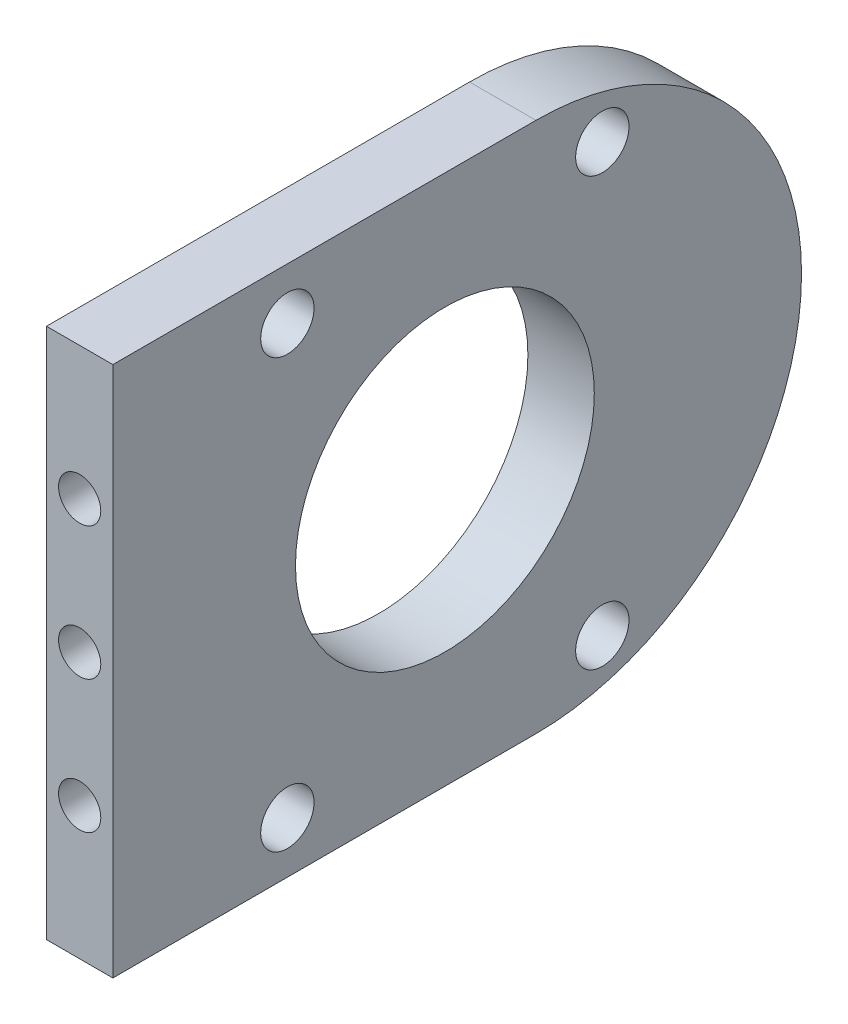
ISO-10303-21;
HEADER;
FILE_DESCRIPTION(('STEP AP214'),'2;1');
FILE_NAME('part.step','',(''),(''),'','','');
FILE_SCHEMA(('AUTOMOTIVE_DESIGN { 1 0 10303 214 1 1 1 1 }'));
ENDSEC;
DATA;
#1=APPLICATION_CONTEXT('core data for automotive mechanical design processes');
#2=APPLICATION_PROTOCOL_DEFINITION('international standard','automotive_design',2000,#1);
#3=PRODUCT_CONTEXT('',#1,'mechanical');
#4=PRODUCT('Part','Part','',(#3));
#5=PRODUCT_RELATED_PRODUCT_CATEGORY('part','',(#4));
#6=PRODUCT_DEFINITION_FORMATION('','',#4);
#7=PRODUCT_DEFINITION_CONTEXT('part definition',#1,'design');
#8=PRODUCT_DEFINITION('design','',#6,#7);
#9=PRODUCT_DEFINITION_SHAPE('','',#8);
#10=(LENGTH_UNIT() NAMED_UNIT(*) SI_UNIT(.MILLI.,.METRE.));
#11=(NAMED_UNIT(*) PLANE_ANGLE_UNIT() SI_UNIT($,.RADIAN.));
#12=(NAMED_UNIT(*) SI_UNIT($,.STERADIAN.) SOLID_ANGLE_UNIT());
#13=UNCERTAINTY_MEASURE_WITH_UNIT(LENGTH_MEASURE(1.E-05),#10,'distance_accuracy_value','');
#14=(GEOMETRIC_REPRESENTATION_CONTEXT(3) GLOBAL_UNCERTAINTY_ASSIGNED_CONTEXT((#13)) GLOBAL_UNIT_ASSIGNED_CONTEXT((#10,
#11,#12)) REPRESENTATION_CONTEXT('',''));
#15=CARTESIAN_POINT('',(0.,0.,0.));
#16=DIRECTION('',(0.,0.,1.));
#17=DIRECTION('',(1.,0.,0.));
#18=AXIS2_PLACEMENT_3D('',#15,#16,#17);
#19=CARTESIAN_POINT('',(6.35,25.4,38.1));
#20=DIRECTION('',(0.,-1.,0.));
#21=DIRECTION('',(0.,0.,-1.));
#22=AXIS2_PLACEMENT_3D('',#19,#20,#21);
#23=PLANE('',#22);
#24=DIRECTION('',(0.,0.,1.));
#25=VECTOR('',#24,1.);
#26=CARTESIAN_POINT('',(6.35,25.4,38.1));
#27=LINE('',#26,#25);
#28=CARTESIAN_POINT('',(6.35,25.4,-2.35410027771774));
#29=VERTEX_POINT('',#28);
#30=CARTESIAN_POINT('',(6.35,25.4,38.1));
#31=VERTEX_POINT('',#30);
#32=EDGE_CURVE('E133',#29,#31,#27,.T.);
#33=ORIENTED_EDGE('',*,*,#32,.F.);
#34=DIRECTION('',(1.,0.,0.));
#35=VECTOR('',#34,1.);
#36=CARTESIAN_POINT('',(6.35,25.4,-2.35410027771775));
#37=LINE('',#36,#35);
#38=CARTESIAN_POINT('',(0.,25.4,-2.35410027771774));
#39=VERTEX_POINT('',#38);
#40=EDGE_CURVE('E155',#29,#39,#37,.F.);
#41=ORIENTED_EDGE('',*,*,#40,.T.);
#42=DIRECTION('',(0.,0.,1.));
#43=VECTOR('',#42,1.);
#44=CARTESIAN_POINT('',(0.,25.4,38.1));
#45=LINE('',#44,#43);
#46=CARTESIAN_POINT('',(0.,25.4,38.1));
#47=VERTEX_POINT('',#46);
#48=EDGE_CURVE('E132',#39,#47,#45,.T.);
#49=ORIENTED_EDGE('',*,*,#48,.T.);
#50=DIRECTION('',(-1.,0.,0.));
#51=VECTOR('',#50,1.);
#52=CARTESIAN_POINT('',(6.35,25.4,38.1));
#53=LINE('',#52,#51);
#54=EDGE_CURVE('E148',#31,#47,#53,.T.);
#55=ORIENTED_EDGE('',*,*,#54,.F.);
#56=EDGE_LOOP('',(#33,#41,#49,#55));
#57=FACE_BOUND('',#56,.T.);
#58=ADVANCED_FACE('F51',(#57),#23,.F.);
#59=CARTESIAN_POINT('',(6.35,-25.4,38.1));
#60=DIRECTION('',(0.,0.,-1.));
#61=DIRECTION('',(-1.,0.,0.));
#62=AXIS2_PLACEMENT_3D('',#59,#60,#61);
#63=PLANE('',#62);
#64=CARTESIAN_POINT('',(3.175,-12.7,38.1));
#65=DIRECTION('',(0.,0.,1.));
#66=DIRECTION('',(1.,0.,0.));
#67=AXIS2_PLACEMENT_3D('',#64,#65,#66);
#68=CIRCLE('',#67,2.01929999999999);
#69=CARTESIAN_POINT('',(5.19429999999999,-12.7,38.1));
#70=VERTEX_POINT('',#69);
#71=EDGE_CURVE('E114',#70,#70,#68,.T.);
#72=ORIENTED_EDGE('',*,*,#71,.F.);
#73=EDGE_LOOP('',(#72));
#74=FACE_BOUND('',#73,.T.);
#75=CARTESIAN_POINT('',(3.175,0.,38.1));
#76=DIRECTION('',(0.,0.,1.));
#77=DIRECTION('',(1.,0.,0.));
#78=AXIS2_PLACEMENT_3D('',#75,#76,#77);
#79=CIRCLE('',#78,2.01929999999999);
#80=CARTESIAN_POINT('',(5.19429999999999,0.,38.1));
#81=VERTEX_POINT('',#80);
#82=EDGE_CURVE('E113',#81,#81,#79,.T.);
#83=ORIENTED_EDGE('',*,*,#82,.F.);
#84=EDGE_LOOP('',(#83));
#85=FACE_BOUND('',#84,.T.);
#86=CARTESIAN_POINT('',(3.175,12.7,38.1));
#87=DIRECTION('',(0.,0.,1.));
#88=DIRECTION('',(1.,0.,0.));
#89=AXIS2_PLACEMENT_3D('',#86,#87,#88);
#90=CIRCLE('',#89,2.01929999999999);
#91=CARTESIAN_POINT('',(5.19429999999999,12.7,38.1));
#92=VERTEX_POINT('',#91);
#93=EDGE_CURVE('E126',#92,#92,#90,.T.);
#94=ORIENTED_EDGE('',*,*,#93,.F.);
#95=EDGE_LOOP('',(#94));
#96=FACE_BOUND('',#95,.T.);
#97=DIRECTION('',(0.,-1.,0.));
#98=VECTOR('',#97,1.);
#99=CARTESIAN_POINT('',(0.,-25.4,38.1));
#100=LINE('',#99,#98);
#101=CARTESIAN_POINT('',(0.,-25.4,38.1));
#102=VERTEX_POINT('',#101);
#103=EDGE_CURVE('E143',#47,#102,#100,.T.);
#104=ORIENTED_EDGE('',*,*,#103,.T.);
#105=DIRECTION('',(-1.,0.,0.));
#106=VECTOR('',#105,1.);
#107=CARTESIAN_POINT('',(6.35,-25.4,38.1));
#108=LINE('',#107,#106);
#109=CARTESIAN_POINT('',(6.35,-25.4,38.1));
#110=VERTEX_POINT('',#109);
#111=EDGE_CURVE('E141',#110,#102,#108,.T.);
#112=ORIENTED_EDGE('',*,*,#111,.F.);
#113=DIRECTION('',(0.,-1.,0.));
#114=VECTOR('',#113,1.);
#115=CARTESIAN_POINT('',(6.35,-25.4,38.1));
#116=LINE('',#115,#114);
#117=EDGE_CURVE('E135',#31,#110,#116,.T.);
#118=ORIENTED_EDGE('',*,*,#117,.F.);
#119=ORIENTED_EDGE('',*,*,#54,.T.);
#120=EDGE_LOOP('',(#104,#112,#118,#119));
#121=FACE_BOUND('',#120,.T.);
#122=ADVANCED_FACE('F170',(#74,#85,#96,#121),#63,.F.);
#123=CARTESIAN_POINT('',(6.35,-25.4,38.1));
#124=DIRECTION('',(0.,1.,0.));
#125=DIRECTION('',(0.,0.,1.));
#126=AXIS2_PLACEMENT_3D('',#123,#124,#125);
#127=PLANE('',#126);
#128=DIRECTION('',(0.,0.,-1.));
#129=VECTOR('',#128,1.);
#130=CARTESIAN_POINT('',(0.,-25.4,38.1));
#131=LINE('',#130,#129);
#132=CARTESIAN_POINT('',(0.,-25.4,-2.35410027771774));
#133=VERTEX_POINT('',#132);
#134=EDGE_CURVE('E136',#102,#133,#131,.T.);
#135=ORIENTED_EDGE('',*,*,#134,.T.);
#136=DIRECTION('',(1.,0.,0.));
#137=VECTOR('',#136,1.);
#138=CARTESIAN_POINT('',(6.35,-25.4,-2.35410027771775));
#139=LINE('',#138,#137);
#140=CARTESIAN_POINT('',(6.35,-25.4,-2.35410027771774));
#141=VERTEX_POINT('',#140);
#142=EDGE_CURVE('E11',#133,#141,#139,.T.);
#143=ORIENTED_EDGE('',*,*,#142,.T.);
#144=DIRECTION('',(0.,0.,-1.));
#145=VECTOR('',#144,1.);
#146=CARTESIAN_POINT('',(6.35,-25.4,38.1));
#147=LINE('',#146,#145);
#148=EDGE_CURVE('E138',#110,#141,#147,.T.);
#149=ORIENTED_EDGE('',*,*,#148,.F.);
#150=ORIENTED_EDGE('',*,*,#111,.T.);
#151=EDGE_LOOP('',(#135,#143,#149,#150));
#152=FACE_BOUND('',#151,.T.);
#153=ADVANCED_FACE('F174',(#152),#127,.F.);
#154=CARTESIAN_POINT('',(6.35,0.,0.));
#155=DIRECTION('',(-1.,0.,0.));
#156=DIRECTION('',(0.,0.,1.));
#157=AXIS2_PLACEMENT_3D('',#154,#155,#156);
#158=PLANE('',#157);
#159=CARTESIAN_POINT('',(6.35,-20.4408227755738,-8.70410027771775));
#160=DIRECTION('',(-1.,0.,0.));
#161=DIRECTION('',(0.,0.,1.));
#162=AXIS2_PLACEMENT_3D('',#159,#160,#161);
#163=CIRCLE('',#162,2.5527);
#164=CARTESIAN_POINT('',(6.35,-20.4408227755738,-6.15140027771775));
#165=VERTEX_POINT('',#164);
#166=EDGE_CURVE('E245',#165,#165,#163,.T.);
#167=ORIENTED_EDGE('',*,*,#166,.T.);
#168=EDGE_LOOP('',(#167));
#169=FACE_BOUND('',#168,.T.);
#170=CARTESIAN_POINT('',(6.35,20.4687166865347,21.4131635587962));
#171=DIRECTION('',(-1.,0.,0.));
#172=DIRECTION('',(0.,0.,1.));
#173=AXIS2_PLACEMENT_3D('',#170,#171,#172);
#174=CIRCLE('',#173,2.5527);
#175=CARTESIAN_POINT('',(6.35,20.4687166865347,23.9658635587962));
#176=VERTEX_POINT('',#175);
#177=EDGE_CURVE('E254',#176,#176,#174,.T.);
#178=ORIENTED_EDGE('',*,*,#177,.T.);
#179=EDGE_LOOP('',(#178));
#180=FACE_BOUND('',#179,.T.);
#181=CARTESIAN_POINT('',(6.35,-20.4687166865347,21.4131635587962));
#182=DIRECTION('',(-1.,0.,0.));
#183=DIRECTION('',(0.,0.,1.));
#184=AXIS2_PLACEMENT_3D('',#181,#182,#183);
#185=CIRCLE('',#184,2.5527);
#186=CARTESIAN_POINT('',(6.35,-20.4687166865347,23.9658635587962));
#187=VERTEX_POINT('',#186);
#188=EDGE_CURVE('E260',#187,#187,#185,.T.);
#189=ORIENTED_EDGE('',*,*,#188,.T.);
#190=EDGE_LOOP('',(#189));
#191=FACE_BOUND('',#190,.T.);
#192=CARTESIAN_POINT('',(6.35,20.4408227755738,-8.70410027771775));
#193=DIRECTION('',(-1.,0.,0.));
#194=DIRECTION('',(0.,0.,1.));
#195=AXIS2_PLACEMENT_3D('',#192,#193,#194);
#196=CIRCLE('',#195,2.5527);
#197=CARTESIAN_POINT('',(6.35,20.4408227755738,-6.15140027771775));
#198=VERTEX_POINT('',#197);
#199=EDGE_CURVE('E266',#198,#198,#196,.T.);
#200=ORIENTED_EDGE('',*,*,#199,.T.);
#201=EDGE_LOOP('',(#200));
#202=FACE_BOUND('',#201,.T.);
#203=CARTESIAN_POINT('',(6.35,0.,6.35000000000001));
#204=DIRECTION('',(1.,0.,0.));
#205=DIRECTION('',(0.,0.,-1.));
#206=AXIS2_PLACEMENT_3D('',#203,#204,#205);
#207=CIRCLE('',#206,14.2875);
#208=CARTESIAN_POINT('',(6.35,0.,-7.93749999999999));
#209=VERTEX_POINT('',#208);
#210=EDGE_CURVE('E269',#209,#209,#207,.T.);
#211=ORIENTED_EDGE('',*,*,#210,.F.);
#212=EDGE_LOOP('',(#211));
#213=FACE_BOUND('',#212,.T.);
#214=CARTESIAN_POINT('',(6.35,0.,-2.35410027771775));
#215=DIRECTION('',(-1.,0.,0.));
#216=DIRECTION('',(0.,0.,1.));
#217=AXIS2_PLACEMENT_3D('',#214,#215,#216);
#218=CIRCLE('',#217,25.4);
#219=CARTESIAN_POINT('',(6.35,0.,-27.7541002777177));
#220=VERTEX_POINT('',#219);
#221=EDGE_CURVE('E151',#141,#220,#218,.F.);
#222=ORIENTED_EDGE('',*,*,#221,.T.);
#223=CARTESIAN_POINT('',(6.35,0.,-2.35410027771775));
#224=DIRECTION('',(-1.,0.,0.));
#225=DIRECTION('',(0.,0.,1.));
#226=AXIS2_PLACEMENT_3D('',#223,#224,#225);
#227=CIRCLE('',#226,25.4);
#228=EDGE_CURVE('E153',#220,#29,#227,.F.);
#229=ORIENTED_EDGE('',*,*,#228,.T.);
#230=ORIENTED_EDGE('',*,*,#32,.T.);
#231=ORIENTED_EDGE('',*,*,#117,.T.);
#232=ORIENTED_EDGE('',*,*,#148,.T.);
#233=EDGE_LOOP('',(#222,#229,#230,#231,#232));
#234=FACE_BOUND('',#233,.T.);
#235=ADVANCED_FACE('F178',(#169,#180,#191,#202,#213,#234),#158,.F.);
#236=CARTESIAN_POINT('',(0.,0.,0.));
#237=DIRECTION('',(-1.,0.,0.));
#238=DIRECTION('',(0.,0.,1.));
#239=AXIS2_PLACEMENT_3D('',#236,#237,#238);
#240=PLANE('',#239);
#241=ORIENTED_EDGE('',*,*,#48,.F.);
#242=CARTESIAN_POINT('',(0.,0.,-2.35410027771775));
#243=DIRECTION('',(-1.,0.,0.));
#244=DIRECTION('',(0.,0.,1.));
#245=AXIS2_PLACEMENT_3D('',#242,#243,#244);
#246=CIRCLE('',#245,25.4);
#247=CARTESIAN_POINT('',(0.,0.,-27.7541002777177));
#248=VERTEX_POINT('',#247);
#249=EDGE_CURVE('E60',#39,#248,#246,.T.);
#250=ORIENTED_EDGE('',*,*,#249,.T.);
#251=CARTESIAN_POINT('',(0.,0.,-2.35410027771775));
#252=DIRECTION('',(-1.,0.,0.));
#253=DIRECTION('',(0.,0.,1.));
#254=AXIS2_PLACEMENT_3D('',#251,#252,#253);
#255=CIRCLE('',#254,25.4);
#256=EDGE_CURVE('E67',#248,#133,#255,.T.);
#257=ORIENTED_EDGE('',*,*,#256,.T.);
#258=ORIENTED_EDGE('',*,*,#134,.F.);
#259=ORIENTED_EDGE('',*,*,#103,.F.);
#260=EDGE_LOOP('',(#241,#250,#257,#258,#259));
#261=FACE_BOUND('',#260,.T.);
#262=CARTESIAN_POINT('',(0.,-20.4408227755738,-8.70410027771775));
#263=DIRECTION('',(-1.,0.,0.));
#264=DIRECTION('',(0.,0.,1.));
#265=AXIS2_PLACEMENT_3D('',#262,#263,#264);
#266=CIRCLE('',#265,2.55269999999999);
#267=CARTESIAN_POINT('',(0.,-20.4408227755738,-6.15140027771776));
#268=VERTEX_POINT('',#267);
#269=EDGE_CURVE('E182',#268,#268,#266,.T.);
#270=ORIENTED_EDGE('',*,*,#269,.F.);
#271=EDGE_LOOP('',(#270));
#272=FACE_BOUND('',#271,.T.);
#273=CARTESIAN_POINT('',(0.,20.4687166865347,21.4131635587962));
#274=DIRECTION('',(-1.,0.,0.));
#275=DIRECTION('',(0.,0.,1.));
#276=AXIS2_PLACEMENT_3D('',#273,#274,#275);
#277=CIRCLE('',#276,2.55269999999999);
#278=CARTESIAN_POINT('',(0.,20.4687166865347,23.9658635587962));
#279=VERTEX_POINT('',#278);
#280=EDGE_CURVE('E249',#279,#279,#277,.T.);
#281=ORIENTED_EDGE('',*,*,#280,.F.);
#282=EDGE_LOOP('',(#281));
#283=FACE_BOUND('',#282,.T.);
#284=CARTESIAN_POINT('',(0.,-20.4687166865347,21.4131635587962));
#285=DIRECTION('',(-1.,0.,0.));
#286=DIRECTION('',(0.,0.,1.));
#287=AXIS2_PLACEMENT_3D('',#284,#285,#286);
#288=CIRCLE('',#287,2.55269999999999);
#289=CARTESIAN_POINT('',(0.,-20.4687166865347,23.9658635587962));
#290=VERTEX_POINT('',#289);
#291=EDGE_CURVE('E257',#290,#290,#288,.T.);
#292=ORIENTED_EDGE('',*,*,#291,.F.);
#293=EDGE_LOOP('',(#292));
#294=FACE_BOUND('',#293,.T.);
#295=CARTESIAN_POINT('',(0.,20.4408227755738,-8.70410027771775));
#296=DIRECTION('',(-1.,0.,0.));
#297=DIRECTION('',(0.,0.,1.));
#298=AXIS2_PLACEMENT_3D('',#295,#296,#297);
#299=CIRCLE('',#298,2.55269999999999);
#300=CARTESIAN_POINT('',(0.,20.4408227755738,-6.15140027771776));
#301=VERTEX_POINT('',#300);
#302=EDGE_CURVE('E263',#301,#301,#299,.T.);
#303=ORIENTED_EDGE('',*,*,#302,.F.);
#304=EDGE_LOOP('',(#303));
#305=FACE_BOUND('',#304,.T.);
#306=CARTESIAN_POINT('',(0.,0.,6.35000000000001));
#307=DIRECTION('',(1.,0.,0.));
#308=DIRECTION('',(0.,0.,-1.));
#309=AXIS2_PLACEMENT_3D('',#306,#307,#308);
#310=CIRCLE('',#309,14.2875);
#311=CARTESIAN_POINT('',(0.,0.,-7.93749999999999));
#312=VERTEX_POINT('',#311);
#313=EDGE_CURVE('E120',#312,#312,#310,.T.);
#314=ORIENTED_EDGE('',*,*,#313,.T.);
#315=EDGE_LOOP('',(#314));
#316=FACE_BOUND('',#315,.T.);
#317=ADVANCED_FACE('F166',(#261,#272,#283,#294,#305,#316),#240,.T.);
#318=CARTESIAN_POINT('',(3.175,12.7,26.07056));
#319=DIRECTION('',(0.,0.,1.));
#320=DIRECTION('',(1.,0.,0.));
#321=AXIS2_PLACEMENT_3D('',#318,#319,#320);
#322=CONICAL_SURFACE('',#321,2.0193,1.02974425867665);
#323=CARTESIAN_POINT('',(3.175,12.7,24.8572421519976));
#324=VERTEX_POINT('',#323);
#325=VERTEX_LOOP('',#324);
#326=FACE_BOUND('',#325,.T.);
#327=CARTESIAN_POINT('',(3.175,12.7,26.07056));
#328=DIRECTION('',(0.,0.,1.));
#329=DIRECTION('',(1.,0.,0.));
#330=AXIS2_PLACEMENT_3D('',#327,#328,#329);
#331=CIRCLE('',#330,2.0193);
#332=CARTESIAN_POINT('',(5.1943,12.7,26.07056));
#333=VERTEX_POINT('',#332);
#334=EDGE_CURVE('E129',#333,#333,#331,.T.);
#335=ORIENTED_EDGE('',*,*,#334,.T.);
#336=EDGE_LOOP('',(#335));
#337=FACE_BOUND('',#336,.T.);
#338=ADVANCED_FACE('F202',(#326,#337),#322,.F.);
#339=CARTESIAN_POINT('',(3.175,12.7,38.1));
#340=DIRECTION('',(0.,0.,1.));
#341=DIRECTION('',(1.,0.,0.));
#342=AXIS2_PLACEMENT_3D('',#339,#340,#341);
#343=CYLINDRICAL_SURFACE('',#342,2.01929999999999);
#344=ORIENTED_EDGE('',*,*,#334,.F.);
#345=EDGE_LOOP('',(#344));
#346=FACE_BOUND('',#345,.T.);
#347=ORIENTED_EDGE('',*,*,#93,.T.);
#348=EDGE_LOOP('',(#347));
#349=FACE_BOUND('',#348,.T.);
#350=ADVANCED_FACE('F208',(#346,#349),#343,.F.);
#351=CARTESIAN_POINT('',(3.175,0.,26.07056));
#352=DIRECTION('',(0.,0.,1.));
#353=DIRECTION('',(1.,0.,0.));
#354=AXIS2_PLACEMENT_3D('',#351,#352,#353);
#355=CONICAL_SURFACE('',#354,2.0193,1.02974425867665);
#356=CARTESIAN_POINT('',(3.175,0.,24.8572421519976));
#357=VERTEX_POINT('',#356);
#358=VERTEX_LOOP('',#357);
#359=FACE_BOUND('',#358,.T.);
#360=CARTESIAN_POINT('',(3.175,0.,26.07056));
#361=DIRECTION('',(0.,0.,1.));
#362=DIRECTION('',(1.,0.,0.));
#363=AXIS2_PLACEMENT_3D('',#360,#361,#362);
#364=CIRCLE('',#363,2.0193);
#365=CARTESIAN_POINT('',(5.1943,0.,26.07056));
#366=VERTEX_POINT('',#365);
#367=EDGE_CURVE('E117',#366,#366,#364,.T.);
#368=ORIENTED_EDGE('',*,*,#367,.T.);
#369=EDGE_LOOP('',(#368));
#370=FACE_BOUND('',#369,.T.);
#371=ADVANCED_FACE('F212',(#359,#370),#355,.F.);
#372=CARTESIAN_POINT('',(3.175,0.,38.1));
#373=DIRECTION('',(0.,0.,1.));
#374=DIRECTION('',(1.,0.,0.));
#375=AXIS2_PLACEMENT_3D('',#372,#373,#374);
#376=CYLINDRICAL_SURFACE('',#375,2.01929999999999);
#377=ORIENTED_EDGE('',*,*,#367,.F.);
#378=EDGE_LOOP('',(#377));
#379=FACE_BOUND('',#378,.T.);
#380=ORIENTED_EDGE('',*,*,#82,.T.);
#381=EDGE_LOOP('',(#380));
#382=FACE_BOUND('',#381,.T.);
#383=ADVANCED_FACE('F107',(#379,#382),#376,.F.);
#384=CARTESIAN_POINT('',(3.175,-12.7,26.07056));
#385=DIRECTION('',(0.,0.,1.));
#386=DIRECTION('',(1.,0.,0.));
#387=AXIS2_PLACEMENT_3D('',#384,#385,#386);
#388=CONICAL_SURFACE('',#387,2.0193,1.02974425867665);
#389=CARTESIAN_POINT('',(3.175,-12.7,24.8572421519976));
#390=VERTEX_POINT('',#389);
#391=VERTEX_LOOP('',#390);
#392=FACE_BOUND('',#391,.T.);
#393=CARTESIAN_POINT('',(3.175,-12.7,26.07056));
#394=DIRECTION('',(0.,0.,1.));
#395=DIRECTION('',(1.,0.,0.));
#396=AXIS2_PLACEMENT_3D('',#393,#394,#395);
#397=CIRCLE('',#396,2.0193);
#398=CARTESIAN_POINT('',(5.1943,-12.7,26.07056));
#399=VERTEX_POINT('',#398);
#400=EDGE_CURVE('E111',#399,#399,#397,.T.);
#401=ORIENTED_EDGE('',*,*,#400,.T.);
#402=EDGE_LOOP('',(#401));
#403=FACE_BOUND('',#402,.T.);
#404=ADVANCED_FACE('F103',(#392,#403),#388,.F.);
#405=CARTESIAN_POINT('',(3.175,-12.7,38.1));
#406=DIRECTION('',(0.,0.,1.));
#407=DIRECTION('',(1.,0.,0.));
#408=AXIS2_PLACEMENT_3D('',#405,#406,#407);
#409=CYLINDRICAL_SURFACE('',#408,2.01929999999999);
#410=ORIENTED_EDGE('',*,*,#400,.F.);
#411=EDGE_LOOP('',(#410));
#412=FACE_BOUND('',#411,.T.);
#413=ORIENTED_EDGE('',*,*,#71,.T.);
#414=EDGE_LOOP('',(#413));
#415=FACE_BOUND('',#414,.T.);
#416=ADVANCED_FACE('F106',(#412,#415),#409,.F.);
#417=CARTESIAN_POINT('',(0.,0.,6.35000000000001));
#418=DIRECTION('',(1.,0.,0.));
#419=DIRECTION('',(0.,0.,-1.));
#420=AXIS2_PLACEMENT_3D('',#417,#418,#419);
#421=CYLINDRICAL_SURFACE('',#420,14.2875);
#422=ORIENTED_EDGE('',*,*,#313,.F.);
#423=EDGE_LOOP('',(#422));
#424=FACE_BOUND('',#423,.T.);
#425=ORIENTED_EDGE('',*,*,#210,.T.);
#426=EDGE_LOOP('',(#425));
#427=FACE_BOUND('',#426,.T.);
#428=ADVANCED_FACE('F222',(#424,#427),#421,.F.);
#429=CARTESIAN_POINT('',(0.,20.4408227755738,-8.70410027771775));
#430=DIRECTION('',(-1.,0.,0.));
#431=DIRECTION('',(0.,0.,1.));
#432=AXIS2_PLACEMENT_3D('',#429,#430,#431);
#433=CYLINDRICAL_SURFACE('',#432,2.55269999999999);
#434=ORIENTED_EDGE('',*,*,#199,.F.);
#435=EDGE_LOOP('',(#434));
#436=FACE_BOUND('',#435,.T.);
#437=ORIENTED_EDGE('',*,*,#302,.T.);
#438=EDGE_LOOP('',(#437));
#439=FACE_BOUND('',#438,.T.);
#440=ADVANCED_FACE('F225',(#436,#439),#433,.F.);
#441=CARTESIAN_POINT('',(0.,-20.4687166865347,21.4131635587962));
#442=DIRECTION('',(-1.,0.,0.));
#443=DIRECTION('',(0.,0.,1.));
#444=AXIS2_PLACEMENT_3D('',#441,#442,#443);
#445=CYLINDRICAL_SURFACE('',#444,2.55269999999999);
#446=ORIENTED_EDGE('',*,*,#188,.F.);
#447=EDGE_LOOP('',(#446));
#448=FACE_BOUND('',#447,.T.);
#449=ORIENTED_EDGE('',*,*,#291,.T.);
#450=EDGE_LOOP('',(#449));
#451=FACE_BOUND('',#450,.T.);
#452=ADVANCED_FACE('F229',(#448,#451),#445,.F.);
#453=CARTESIAN_POINT('',(0.,20.4687166865347,21.4131635587962));
#454=DIRECTION('',(-1.,0.,0.));
#455=DIRECTION('',(0.,0.,1.));
#456=AXIS2_PLACEMENT_3D('',#453,#454,#455);
#457=CYLINDRICAL_SURFACE('',#456,2.55269999999999);
#458=ORIENTED_EDGE('',*,*,#177,.F.);
#459=EDGE_LOOP('',(#458));
#460=FACE_BOUND('',#459,.T.);
#461=ORIENTED_EDGE('',*,*,#280,.T.);
#462=EDGE_LOOP('',(#461));
#463=FACE_BOUND('',#462,.T.);
#464=ADVANCED_FACE('F233',(#460,#463),#457,.F.);
#465=CARTESIAN_POINT('',(0.,-20.4408227755738,-8.70410027771775));
#466=DIRECTION('',(-1.,0.,0.));
#467=DIRECTION('',(0.,0.,1.));
#468=AXIS2_PLACEMENT_3D('',#465,#466,#467);
#469=CYLINDRICAL_SURFACE('',#468,2.55269999999999);
#470=ORIENTED_EDGE('',*,*,#166,.F.);
#471=EDGE_LOOP('',(#470));
#472=FACE_BOUND('',#471,.T.);
#473=ORIENTED_EDGE('',*,*,#269,.T.);
#474=EDGE_LOOP('',(#473));
#475=FACE_BOUND('',#474,.T.);
#476=ADVANCED_FACE('F188',(#472,#475),#469,.F.);
#477=CARTESIAN_POINT('',(6.35,0.,-2.35410027771775));
#478=DIRECTION('',(1.,0.,0.));
#479=DIRECTION('',(0.,0.,-1.));
#480=AXIS2_PLACEMENT_3D('',#477,#478,#479);
#481=CYLINDRICAL_SURFACE('',#480,25.4);
#482=ORIENTED_EDGE('',*,*,#142,.F.);
#483=ORIENTED_EDGE('',*,*,#256,.F.);
#484=DIRECTION('',(1.,0.,0.));
#485=VECTOR('',#484,1.);
#486=CARTESIAN_POINT('',(0.,0.,-27.7541002777177));
#487=LINE('',#486,#485);
#488=EDGE_CURVE('E55',#220,#248,#487,.F.);
#489=ORIENTED_EDGE('',*,*,#488,.F.);
#490=ORIENTED_EDGE('',*,*,#221,.F.);
#491=EDGE_LOOP('',(#482,#483,#489,#490));
#492=FACE_BOUND('',#491,.T.);
#493=ADVANCED_FACE('F53',(#492),#481,.T.);
#494=CARTESIAN_POINT('',(0.,0.,-2.35410027771775));
#495=DIRECTION('',(1.,0.,0.));
#496=DIRECTION('',(0.,0.,-1.));
#497=AXIS2_PLACEMENT_3D('',#494,#495,#496);
#498=CYLINDRICAL_SURFACE('',#497,25.4);
#499=ORIENTED_EDGE('',*,*,#249,.F.);
#500=ORIENTED_EDGE('',*,*,#40,.F.);
#501=ORIENTED_EDGE('',*,*,#228,.F.);
#502=ORIENTED_EDGE('',*,*,#488,.T.);
#503=EDGE_LOOP('',(#499,#500,#501,#502));
#504=FACE_BOUND('',#503,.T.);
#505=ADVANCED_FACE('F183',(#504),#498,.T.);
#506=CLOSED_SHELL('',(#58,#122,#153,#235,#317,#338,#350,#371,#383,#404,#416,#428,#440,#452,#464,
#476,#493,#505));
#507=MANIFOLD_SOLID_BREP('B2',#506);
#508=ADVANCED_BREP_SHAPE_REPRESENTATION('',(#18,#507),#14);
#509=SHAPE_DEFINITION_REPRESENTATION(#9,#508);
ENDSEC;
END-ISO-10303-21;
